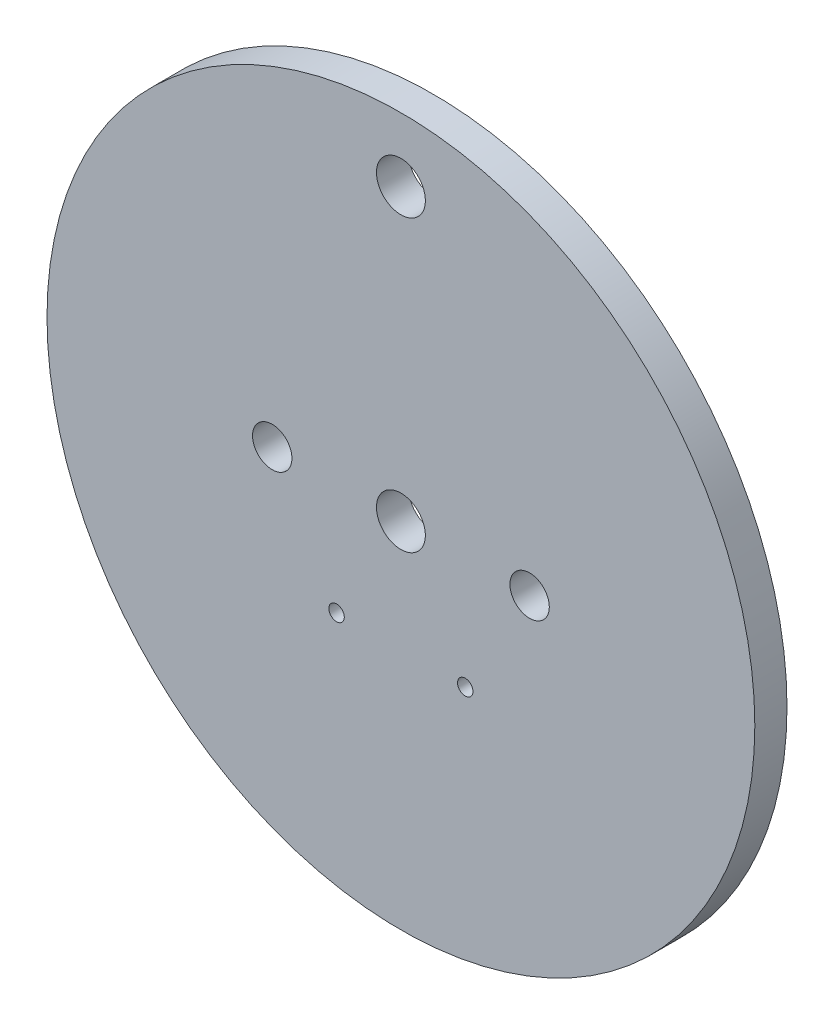
ISO-10303-21;
HEADER;
FILE_DESCRIPTION(('STEP AP214'),'2;1');
FILE_NAME('part.step','',(''),(''),'','','');
FILE_SCHEMA(('AUTOMOTIVE_DESIGN { 1 0 10303 214 1 1 1 1 }'));
ENDSEC;
DATA;
#1=APPLICATION_CONTEXT('core data for automotive mechanical design processes');
#2=APPLICATION_PROTOCOL_DEFINITION('international standard','automotive_design',2000,#1);
#3=PRODUCT_CONTEXT('',#1,'mechanical');
#4=PRODUCT('Part','Part','',(#3));
#5=PRODUCT_RELATED_PRODUCT_CATEGORY('part','',(#4));
#6=PRODUCT_DEFINITION_FORMATION('','',#4);
#7=PRODUCT_DEFINITION_CONTEXT('part definition',#1,'design');
#8=PRODUCT_DEFINITION('design','',#6,#7);
#9=PRODUCT_DEFINITION_SHAPE('','',#8);
#10=(LENGTH_UNIT() NAMED_UNIT(*) SI_UNIT(.MILLI.,.METRE.));
#11=(NAMED_UNIT(*) PLANE_ANGLE_UNIT() SI_UNIT($,.RADIAN.));
#12=(NAMED_UNIT(*) SI_UNIT($,.STERADIAN.) SOLID_ANGLE_UNIT());
#13=UNCERTAINTY_MEASURE_WITH_UNIT(LENGTH_MEASURE(1.E-05),#10,'distance_accuracy_value','');
#14=(GEOMETRIC_REPRESENTATION_CONTEXT(3) GLOBAL_UNCERTAINTY_ASSIGNED_CONTEXT((#13)) GLOBAL_UNIT_ASSIGNED_CONTEXT((#10,
#11,#12)) REPRESENTATION_CONTEXT('',''));
#15=CARTESIAN_POINT('',(0.,0.,0.));
#16=DIRECTION('',(0.,0.,1.));
#17=DIRECTION('',(1.,0.,0.));
#18=AXIS2_PLACEMENT_3D('',#15,#16,#17);
#19=CARTESIAN_POINT('',(67.638168,-28.6031457402461,-3.175));
#20=DIRECTION('',(0.,0.,1.));
#21=DIRECTION('',(-1.,0.,0.));
#22=AXIS2_PLACEMENT_3D('',#19,#20,#21);
#23=CYLINDRICAL_SURFACE('',#22,34.925);
#24=CARTESIAN_POINT('',(67.638168,-28.6031457402461,-3.175));
#25=DIRECTION('',(0.,0.,1.));
#26=DIRECTION('',(1.,0.,0.));
#27=AXIS2_PLACEMENT_3D('',#24,#25,#26);
#28=CIRCLE('',#27,34.925);
#29=CARTESIAN_POINT('',(102.563168,-28.6031457402461,-3.175));
#30=VERTEX_POINT('',#29);
#31=EDGE_CURVE('E10',#30,#30,#28,.T.);
#32=ORIENTED_EDGE('',*,*,#31,.T.);
#33=EDGE_LOOP('',(#32));
#34=FACE_BOUND('',#33,.T.);
#35=CARTESIAN_POINT('',(67.638168,-28.6031457402461,0.));
#36=DIRECTION('',(0.,0.,1.));
#37=DIRECTION('',(1.,0.,0.));
#38=AXIS2_PLACEMENT_3D('',#35,#36,#37);
#39=CIRCLE('',#38,34.925);
#40=CARTESIAN_POINT('',(102.563168,-28.6031457402461,0.));
#41=VERTEX_POINT('',#40);
#42=EDGE_CURVE('E33',#41,#41,#39,.T.);
#43=ORIENTED_EDGE('',*,*,#42,.F.);
#44=EDGE_LOOP('',(#43));
#45=FACE_BOUND('',#44,.T.);
#46=ADVANCED_FACE('F30',(#34,#45),#23,.T.);
#47=CARTESIAN_POINT('',(67.638168,-28.6031457402461,-3.175));
#48=DIRECTION('',(0.,0.,-1.));
#49=DIRECTION('',(1.,0.,0.));
#50=AXIS2_PLACEMENT_3D('',#47,#48,#49);
#51=PLANE('',#50);
#52=CARTESIAN_POINT('',(73.988168,-39.6016683683084,-3.175));
#53=DIRECTION('',(0.,0.,1.));
#54=DIRECTION('',(1.,0.,0.));
#55=AXIS2_PLACEMENT_3D('',#52,#53,#54);
#56=CIRCLE('',#55,0.762000000000003);
#57=CARTESIAN_POINT('',(74.750168,-39.6016683683084,-3.175));
#58=VERTEX_POINT('',#57);
#59=EDGE_CURVE('E74',#58,#58,#56,.T.);
#60=ORIENTED_EDGE('',*,*,#59,.T.);
#61=EDGE_LOOP('',(#60));
#62=FACE_BOUND('',#61,.T.);
#63=CARTESIAN_POINT('',(80.338168,-28.6031457402461,-3.175));
#64=DIRECTION('',(0.,0.,1.));
#65=DIRECTION('',(-1.,0.,0.));
#66=AXIS2_PLACEMENT_3D('',#63,#64,#65);
#67=CIRCLE('',#66,1.9431);
#68=CARTESIAN_POINT('',(78.395068,-28.6031457402461,-3.175));
#69=VERTEX_POINT('',#68);
#70=EDGE_CURVE('E68',#69,#69,#67,.T.);
#71=ORIENTED_EDGE('',*,*,#70,.T.);
#72=EDGE_LOOP('',(#71));
#73=FACE_BOUND('',#72,.T.);
#74=CARTESIAN_POINT('',(61.288168,-39.6016683683084,-3.175));
#75=DIRECTION('',(0.,0.,1.));
#76=DIRECTION('',(1.,0.,0.));
#77=AXIS2_PLACEMENT_3D('',#74,#75,#76);
#78=CIRCLE('',#77,0.761999999999996);
#79=CARTESIAN_POINT('',(62.050168,-39.6016683683084,-3.175));
#80=VERTEX_POINT('',#79);
#81=EDGE_CURVE('E62',#80,#80,#78,.T.);
#82=ORIENTED_EDGE('',*,*,#81,.T.);
#83=EDGE_LOOP('',(#82));
#84=FACE_BOUND('',#83,.T.);
#85=CARTESIAN_POINT('',(54.938168,-28.6031457402461,-3.175));
#86=DIRECTION('',(0.,0.,1.));
#87=DIRECTION('',(1.,0.,0.));
#88=AXIS2_PLACEMENT_3D('',#85,#86,#87);
#89=CIRCLE('',#88,1.9431);
#90=CARTESIAN_POINT('',(56.881268,-28.6031457402461,-3.175));
#91=VERTEX_POINT('',#90);
#92=EDGE_CURVE('E56',#91,#91,#89,.T.);
#93=ORIENTED_EDGE('',*,*,#92,.T.);
#94=EDGE_LOOP('',(#93));
#95=FACE_BOUND('',#94,.T.);
#96=CARTESIAN_POINT('',(67.638168,-28.6031457402461,-3.175));
#97=DIRECTION('',(0.,0.,1.));
#98=DIRECTION('',(1.,0.,0.));
#99=AXIS2_PLACEMENT_3D('',#96,#97,#98);
#100=CIRCLE('',#99,2.41299999999999);
#101=CARTESIAN_POINT('',(70.051168,-28.6031457402461,-3.175));
#102=VERTEX_POINT('',#101);
#103=EDGE_CURVE('E50',#102,#102,#100,.T.);
#104=ORIENTED_EDGE('',*,*,#103,.T.);
#105=EDGE_LOOP('',(#104));
#106=FACE_BOUND('',#105,.T.);
#107=CARTESIAN_POINT('',(67.638168,0.,-3.175));
#108=DIRECTION('',(0.,0.,1.));
#109=DIRECTION('',(1.,0.,0.));
#110=AXIS2_PLACEMENT_3D('',#107,#108,#109);
#111=CIRCLE('',#110,2.413);
#112=CARTESIAN_POINT('',(70.051168,0.,-3.175));
#113=VERTEX_POINT('',#112);
#114=EDGE_CURVE('E44',#113,#113,#111,.T.);
#115=ORIENTED_EDGE('',*,*,#114,.T.);
#116=EDGE_LOOP('',(#115));
#117=FACE_BOUND('',#116,.T.);
#118=ORIENTED_EDGE('',*,*,#31,.F.);
#119=EDGE_LOOP('',(#118));
#120=FACE_BOUND('',#119,.T.);
#121=ADVANCED_FACE('F78',(#62,#73,#84,#95,#106,#117,#120),#51,.T.);
#122=CARTESIAN_POINT('',(67.638168,-28.6031457402461,0.));
#123=DIRECTION('',(0.,0.,-1.));
#124=DIRECTION('',(1.,0.,0.));
#125=AXIS2_PLACEMENT_3D('',#122,#123,#124);
#126=PLANE('',#125);
#127=CARTESIAN_POINT('',(73.988168,-39.6016683683084,0.));
#128=DIRECTION('',(0.,0.,1.));
#129=DIRECTION('',(1.,0.,0.));
#130=AXIS2_PLACEMENT_3D('',#127,#128,#129);
#131=CIRCLE('',#130,0.762000000000003);
#132=CARTESIAN_POINT('',(74.750168,-39.6016683683084,0.));
#133=VERTEX_POINT('',#132);
#134=EDGE_CURVE('E71',#133,#133,#131,.F.);
#135=ORIENTED_EDGE('',*,*,#134,.T.);
#136=EDGE_LOOP('',(#135));
#137=FACE_BOUND('',#136,.T.);
#138=CARTESIAN_POINT('',(80.338168,-28.6031457402461,0.));
#139=DIRECTION('',(0.,0.,1.));
#140=DIRECTION('',(1.,0.,0.));
#141=AXIS2_PLACEMENT_3D('',#138,#139,#140);
#142=CIRCLE('',#141,1.9431);
#143=CARTESIAN_POINT('',(82.281268,-28.6031457402461,0.));
#144=VERTEX_POINT('',#143);
#145=EDGE_CURVE('E65',#144,#144,#142,.F.);
#146=ORIENTED_EDGE('',*,*,#145,.T.);
#147=EDGE_LOOP('',(#146));
#148=FACE_BOUND('',#147,.T.);
#149=CARTESIAN_POINT('',(61.288168,-39.6016683683084,0.));
#150=DIRECTION('',(0.,0.,1.));
#151=DIRECTION('',(1.,0.,0.));
#152=AXIS2_PLACEMENT_3D('',#149,#150,#151);
#153=CIRCLE('',#152,0.761999999999996);
#154=CARTESIAN_POINT('',(62.050168,-39.6016683683084,0.));
#155=VERTEX_POINT('',#154);
#156=EDGE_CURVE('E59',#155,#155,#153,.F.);
#157=ORIENTED_EDGE('',*,*,#156,.T.);
#158=EDGE_LOOP('',(#157));
#159=FACE_BOUND('',#158,.T.);
#160=CARTESIAN_POINT('',(54.938168,-28.6031457402461,0.));
#161=DIRECTION('',(0.,0.,1.));
#162=DIRECTION('',(1.,0.,0.));
#163=AXIS2_PLACEMENT_3D('',#160,#161,#162);
#164=CIRCLE('',#163,1.9431);
#165=CARTESIAN_POINT('',(56.881268,-28.6031457402461,0.));
#166=VERTEX_POINT('',#165);
#167=EDGE_CURVE('E53',#166,#166,#164,.F.);
#168=ORIENTED_EDGE('',*,*,#167,.T.);
#169=EDGE_LOOP('',(#168));
#170=FACE_BOUND('',#169,.T.);
#171=CARTESIAN_POINT('',(67.638168,-28.6031457402461,0.));
#172=DIRECTION('',(0.,0.,1.));
#173=DIRECTION('',(1.,0.,0.));
#174=AXIS2_PLACEMENT_3D('',#171,#172,#173);
#175=CIRCLE('',#174,2.41299999999999);
#176=CARTESIAN_POINT('',(70.051168,-28.6031457402461,0.));
#177=VERTEX_POINT('',#176);
#178=EDGE_CURVE('E47',#177,#177,#175,.F.);
#179=ORIENTED_EDGE('',*,*,#178,.T.);
#180=EDGE_LOOP('',(#179));
#181=FACE_BOUND('',#180,.T.);
#182=CARTESIAN_POINT('',(67.638168,0.,0.));
#183=DIRECTION('',(0.,0.,1.));
#184=DIRECTION('',(1.,0.,0.));
#185=AXIS2_PLACEMENT_3D('',#182,#183,#184);
#186=CIRCLE('',#185,2.413);
#187=CARTESIAN_POINT('',(70.051168,0.,0.));
#188=VERTEX_POINT('',#187);
#189=EDGE_CURVE('E40',#188,#188,#186,.F.);
#190=ORIENTED_EDGE('',*,*,#189,.T.);
#191=EDGE_LOOP('',(#190));
#192=FACE_BOUND('',#191,.T.);
#193=ORIENTED_EDGE('',*,*,#42,.T.);
#194=EDGE_LOOP('',(#193));
#195=FACE_BOUND('',#194,.T.);
#196=ADVANCED_FACE('F88',(#137,#148,#159,#170,#181,#192,#195),#126,.F.);
#197=CARTESIAN_POINT('',(67.638168,0.,0.00100000000000013));
#198=DIRECTION('',(0.,0.,-1.));
#199=DIRECTION('',(1.,0.,0.));
#200=AXIS2_PLACEMENT_3D('',#197,#198,#199);
#201=CYLINDRICAL_SURFACE('',#200,2.413);
#202=ORIENTED_EDGE('',*,*,#114,.F.);
#203=EDGE_LOOP('',(#202));
#204=FACE_BOUND('',#203,.T.);
#205=ORIENTED_EDGE('',*,*,#189,.F.);
#206=EDGE_LOOP('',(#205));
#207=FACE_BOUND('',#206,.T.);
#208=ADVANCED_FACE('F91',(#204,#207),#201,.F.);
#209=CARTESIAN_POINT('',(67.638168,-28.6031457402461,0.00100000000000013));
#210=DIRECTION('',(0.,0.,-1.));
#211=DIRECTION('',(1.,0.,0.));
#212=AXIS2_PLACEMENT_3D('',#209,#210,#211);
#213=CYLINDRICAL_SURFACE('',#212,2.41299999999999);
#214=ORIENTED_EDGE('',*,*,#103,.F.);
#215=EDGE_LOOP('',(#214));
#216=FACE_BOUND('',#215,.T.);
#217=ORIENTED_EDGE('',*,*,#178,.F.);
#218=EDGE_LOOP('',(#217));
#219=FACE_BOUND('',#218,.T.);
#220=ADVANCED_FACE('F114',(#216,#219),#213,.F.);
#221=CARTESIAN_POINT('',(54.938168,-28.6031457402461,0.00100000000000013));
#222=DIRECTION('',(0.,0.,-1.));
#223=DIRECTION('',(1.,0.,0.));
#224=AXIS2_PLACEMENT_3D('',#221,#222,#223);
#225=CYLINDRICAL_SURFACE('',#224,1.9431);
#226=ORIENTED_EDGE('',*,*,#92,.F.);
#227=EDGE_LOOP('',(#226));
#228=FACE_BOUND('',#227,.T.);
#229=ORIENTED_EDGE('',*,*,#167,.F.);
#230=EDGE_LOOP('',(#229));
#231=FACE_BOUND('',#230,.T.);
#232=ADVANCED_FACE('F118',(#228,#231),#225,.F.);
#233=CARTESIAN_POINT('',(61.288168,-39.6016683683084,0.00100000000000013));
#234=DIRECTION('',(0.,0.,-1.));
#235=DIRECTION('',(1.,0.,0.));
#236=AXIS2_PLACEMENT_3D('',#233,#234,#235);
#237=CYLINDRICAL_SURFACE('',#236,0.761999999999996);
#238=ORIENTED_EDGE('',*,*,#81,.F.);
#239=EDGE_LOOP('',(#238));
#240=FACE_BOUND('',#239,.T.);
#241=ORIENTED_EDGE('',*,*,#156,.F.);
#242=EDGE_LOOP('',(#241));
#243=FACE_BOUND('',#242,.T.);
#244=ADVANCED_FACE('F122',(#240,#243),#237,.F.);
#245=CARTESIAN_POINT('',(80.338168,-28.6031457402461,0.00100000000000013));
#246=DIRECTION('',(0.,0.,-1.));
#247=DIRECTION('',(1.,0.,0.));
#248=AXIS2_PLACEMENT_3D('',#245,#246,#247);
#249=CYLINDRICAL_SURFACE('',#248,1.9431);
#250=ORIENTED_EDGE('',*,*,#70,.F.);
#251=EDGE_LOOP('',(#250));
#252=FACE_BOUND('',#251,.T.);
#253=ORIENTED_EDGE('',*,*,#145,.F.);
#254=EDGE_LOOP('',(#253));
#255=FACE_BOUND('',#254,.T.);
#256=ADVANCED_FACE('F84',(#252,#255),#249,.F.);
#257=CARTESIAN_POINT('',(73.988168,-39.6016683683084,0.00100000000000013));
#258=DIRECTION('',(0.,0.,-1.));
#259=DIRECTION('',(1.,0.,0.));
#260=AXIS2_PLACEMENT_3D('',#257,#258,#259);
#261=CYLINDRICAL_SURFACE('',#260,0.762000000000003);
#262=ORIENTED_EDGE('',*,*,#59,.F.);
#263=EDGE_LOOP('',(#262));
#264=FACE_BOUND('',#263,.T.);
#265=ORIENTED_EDGE('',*,*,#134,.F.);
#266=EDGE_LOOP('',(#265));
#267=FACE_BOUND('',#266,.T.);
#268=ADVANCED_FACE('F81',(#264,#267),#261,.F.);
#269=CLOSED_SHELL('',(#46,#121,#196,#208,#220,#232,#244,#256,#268));
#270=MANIFOLD_SOLID_BREP('B2',#269);
#271=ADVANCED_BREP_SHAPE_REPRESENTATION('',(#18,#270),#14);
#272=SHAPE_DEFINITION_REPRESENTATION(#9,#271);
ENDSEC;
END-ISO-10303-21;
